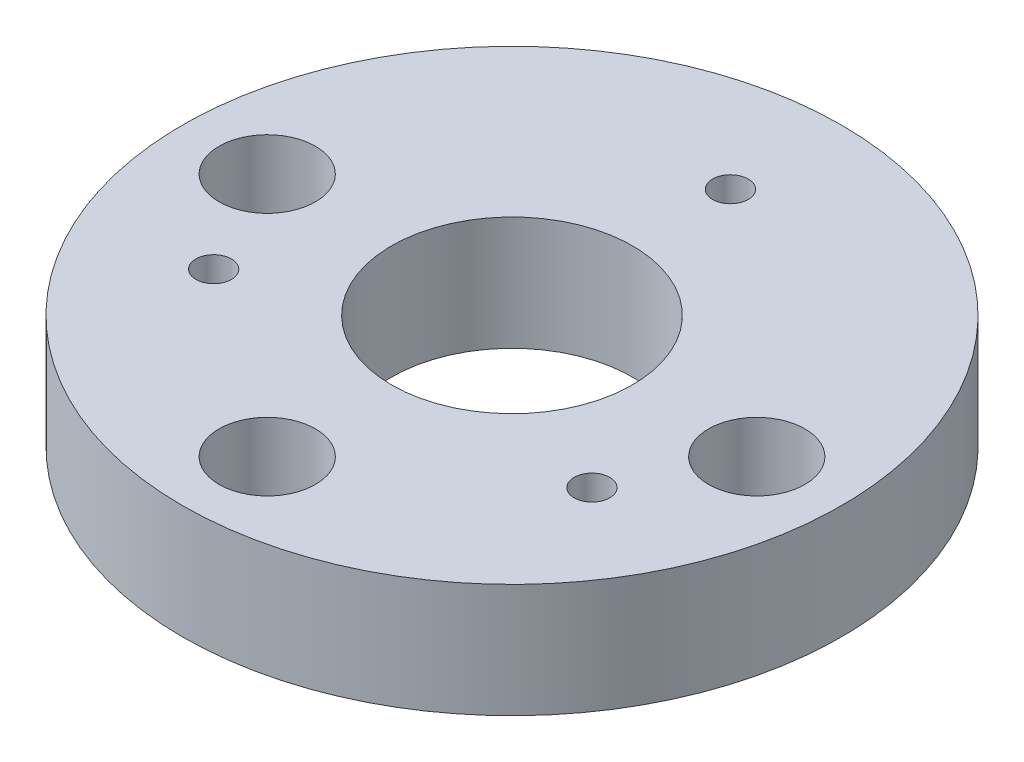
ISO-10303-21;
HEADER;
FILE_DESCRIPTION(('STEP AP214'),'2;1');
FILE_NAME('part.step','',(''),(''),'','','');
FILE_SCHEMA(('AUTOMOTIVE_DESIGN { 1 0 10303 214 1 1 1 1 }'));
ENDSEC;
DATA;
#1=APPLICATION_CONTEXT('core data for automotive mechanical design processes');
#2=APPLICATION_PROTOCOL_DEFINITION('international standard','automotive_design',2000,#1);
#3=PRODUCT_CONTEXT('',#1,'mechanical');
#4=PRODUCT('Part','Part','',(#3));
#5=PRODUCT_RELATED_PRODUCT_CATEGORY('part','',(#4));
#6=PRODUCT_DEFINITION_FORMATION('','',#4);
#7=PRODUCT_DEFINITION_CONTEXT('part definition',#1,'design');
#8=PRODUCT_DEFINITION('design','',#6,#7);
#9=PRODUCT_DEFINITION_SHAPE('','',#8);
#10=(LENGTH_UNIT() NAMED_UNIT(*) SI_UNIT(.MILLI.,.METRE.));
#11=(NAMED_UNIT(*) PLANE_ANGLE_UNIT() SI_UNIT($,.RADIAN.));
#12=(NAMED_UNIT(*) SI_UNIT($,.STERADIAN.) SOLID_ANGLE_UNIT());
#13=UNCERTAINTY_MEASURE_WITH_UNIT(LENGTH_MEASURE(1.E-05),#10,'distance_accuracy_value','');
#14=(GEOMETRIC_REPRESENTATION_CONTEXT(3) GLOBAL_UNCERTAINTY_ASSIGNED_CONTEXT((#13)) GLOBAL_UNIT_ASSIGNED_CONTEXT((#10,
#11,#12)) REPRESENTATION_CONTEXT('',''));
#15=CARTESIAN_POINT('',(0.,0.,0.));
#16=DIRECTION('',(0.,0.,1.));
#17=DIRECTION('',(1.,0.,0.));
#18=AXIS2_PLACEMENT_3D('',#15,#16,#17);
#19=CARTESIAN_POINT('',(20.6375,0.,0.));
#20=DIRECTION('',(0.,1.,0.));
#21=DIRECTION('',(0.,0.,1.));
#22=AXIS2_PLACEMENT_3D('',#19,#20,#21);
#23=CYLINDRICAL_SURFACE('',#22,1.83872486259726);
#24=CARTESIAN_POINT('',(20.6375,0.,0.));
#25=DIRECTION('',(0.,1.,0.));
#26=DIRECTION('',(0.,0.,1.));
#27=AXIS2_PLACEMENT_3D('',#24,#25,#26);
#28=CIRCLE('',#27,1.83872486259726);
#29=CARTESIAN_POINT('',(20.6375,0.,1.83872486259726));
#30=VERTEX_POINT('',#29);
#31=EDGE_CURVE('E82',#30,#30,#28,.T.);
#32=ORIENTED_EDGE('',*,*,#31,.F.);
#33=EDGE_LOOP('',(#32));
#34=FACE_BOUND('',#33,.T.);
#35=CARTESIAN_POINT('',(20.6375,3.5885,0.));
#36=DIRECTION('',(0.,1.,0.));
#37=DIRECTION('',(0.,0.,1.));
#38=AXIS2_PLACEMENT_3D('',#35,#36,#37);
#39=CIRCLE('',#38,1.83872486259726);
#40=CARTESIAN_POINT('',(20.6375,3.5885,1.83872486259726));
#41=VERTEX_POINT('',#40);
#42=EDGE_CURVE('E37',#41,#41,#39,.F.);
#43=ORIENTED_EDGE('',*,*,#42,.F.);
#44=EDGE_LOOP('',(#43));
#45=FACE_BOUND('',#44,.T.);
#46=ADVANCED_FACE('F33',(#34,#45),#23,.F.);
#47=CARTESIAN_POINT('',(0.,0.,20.6375));
#48=DIRECTION('',(0.,1.,0.));
#49=DIRECTION('',(0.,0.,1.));
#50=AXIS2_PLACEMENT_3D('',#47,#48,#49);
#51=CYLINDRICAL_SURFACE('',#50,1.83872486259726);
#52=CARTESIAN_POINT('',(0.,0.,20.6375));
#53=DIRECTION('',(0.,1.,0.));
#54=DIRECTION('',(0.,0.,1.));
#55=AXIS2_PLACEMENT_3D('',#52,#53,#54);
#56=CIRCLE('',#55,1.83872486259726);
#57=CARTESIAN_POINT('',(0.,0.,22.4762248625973));
#58=VERTEX_POINT('',#57);
#59=EDGE_CURVE('E79',#58,#58,#56,.T.);
#60=ORIENTED_EDGE('',*,*,#59,.F.);
#61=EDGE_LOOP('',(#60));
#62=FACE_BOUND('',#61,.T.);
#63=CARTESIAN_POINT('',(0.,3.5885,20.6375));
#64=DIRECTION('',(0.,1.,0.));
#65=DIRECTION('',(0.,0.,1.));
#66=AXIS2_PLACEMENT_3D('',#63,#64,#65);
#67=CIRCLE('',#66,1.83872486259726);
#68=CARTESIAN_POINT('',(0.,3.5885,22.4762248625973));
#69=VERTEX_POINT('',#68);
#70=EDGE_CURVE('E54',#69,#69,#67,.F.);
#71=ORIENTED_EDGE('',*,*,#70,.F.);
#72=EDGE_LOOP('',(#71));
#73=FACE_BOUND('',#72,.T.);
#74=ADVANCED_FACE('F159',(#62,#73),#51,.F.);
#75=CARTESIAN_POINT('',(-20.6375,0.,0.));
#76=DIRECTION('',(0.,1.,0.));
#77=DIRECTION('',(0.,0.,1.));
#78=AXIS2_PLACEMENT_3D('',#75,#76,#77);
#79=CYLINDRICAL_SURFACE('',#78,1.83872486259726);
#80=CARTESIAN_POINT('',(-20.6375,0.,0.));
#81=DIRECTION('',(0.,1.,0.));
#82=DIRECTION('',(0.,0.,1.));
#83=AXIS2_PLACEMENT_3D('',#80,#81,#82);
#84=CIRCLE('',#83,1.83872486259726);
#85=CARTESIAN_POINT('',(-20.6375,0.,1.83872486259726));
#86=VERTEX_POINT('',#85);
#87=EDGE_CURVE('E52',#86,#86,#84,.T.);
#88=ORIENTED_EDGE('',*,*,#87,.F.);
#89=EDGE_LOOP('',(#88));
#90=FACE_BOUND('',#89,.T.);
#91=CARTESIAN_POINT('',(-20.6375,3.5885,0.));
#92=DIRECTION('',(0.,1.,0.));
#93=DIRECTION('',(0.,0.,1.));
#94=AXIS2_PLACEMENT_3D('',#91,#92,#93);
#95=CIRCLE('',#94,1.83872486259726);
#96=CARTESIAN_POINT('',(-20.6375,3.5885,1.83872486259726));
#97=VERTEX_POINT('',#96);
#98=EDGE_CURVE('E50',#97,#97,#95,.F.);
#99=ORIENTED_EDGE('',*,*,#98,.F.);
#100=EDGE_LOOP('',(#99));
#101=FACE_BOUND('',#100,.T.);
#102=ADVANCED_FACE('F165',(#90,#101),#79,.F.);
#103=CARTESIAN_POINT('',(0.,9.5885,0.));
#104=DIRECTION('',(0.,1.,0.));
#105=DIRECTION('',(0.,0.,1.));
#106=AXIS2_PLACEMENT_3D('',#103,#104,#105);
#107=PLANE('',#106);
#108=CARTESIAN_POINT('',(0.,9.5885,20.6375));
#109=DIRECTION('',(0.,1.,0.));
#110=DIRECTION('',(0.,0.,1.));
#111=AXIS2_PLACEMENT_3D('',#108,#109,#110);
#112=CIRCLE('',#111,4.064);
#113=CARTESIAN_POINT('',(0.,9.5885,24.7015));
#114=VERTEX_POINT('',#113);
#115=EDGE_CURVE('E62',#114,#114,#112,.T.);
#116=ORIENTED_EDGE('',*,*,#115,.F.);
#117=EDGE_LOOP('',(#116));
#118=FACE_BOUND('',#117,.T.);
#119=CARTESIAN_POINT('',(20.6375,9.5885,0.));
#120=DIRECTION('',(0.,1.,0.));
#121=DIRECTION('',(0.,0.,1.));
#122=AXIS2_PLACEMENT_3D('',#119,#120,#121);
#123=CIRCLE('',#122,4.064);
#124=CARTESIAN_POINT('',(20.6375,9.5885,4.064));
#125=VERTEX_POINT('',#124);
#126=EDGE_CURVE('E72',#125,#125,#123,.T.);
#127=ORIENTED_EDGE('',*,*,#126,.F.);
#128=EDGE_LOOP('',(#127));
#129=FACE_BOUND('',#128,.T.);
#130=CARTESIAN_POINT('',(-20.6375,9.5885,0.));
#131=DIRECTION('',(0.,1.,0.));
#132=DIRECTION('',(0.,0.,1.));
#133=AXIS2_PLACEMENT_3D('',#130,#131,#132);
#134=CIRCLE('',#133,4.064);
#135=CARTESIAN_POINT('',(-20.6375,9.5885,4.064));
#136=VERTEX_POINT('',#135);
#137=EDGE_CURVE('E60',#136,#136,#134,.T.);
#138=ORIENTED_EDGE('',*,*,#137,.F.);
#139=EDGE_LOOP('',(#138));
#140=FACE_BOUND('',#139,.T.);
#141=CARTESIAN_POINT('',(15.9478578106922,9.5885,9.20750000000042));
#142=DIRECTION('',(0.,1.,0.));
#143=DIRECTION('',(0.,0.,1.));
#144=AXIS2_PLACEMENT_3D('',#141,#142,#143);
#145=CIRCLE('',#144,1.5);
#146=CARTESIAN_POINT('',(15.9478578106922,9.5885,10.7075000000004));
#147=VERTEX_POINT('',#146);
#148=EDGE_CURVE('E88',#147,#147,#145,.T.);
#149=ORIENTED_EDGE('',*,*,#148,.F.);
#150=EDGE_LOOP('',(#149));
#151=FACE_BOUND('',#150,.T.);
#152=CARTESIAN_POINT('',(-15.9478578106887,9.5885,9.20749999999958));
#153=DIRECTION('',(0.,1.,0.));
#154=DIRECTION('',(0.,0.,1.));
#155=AXIS2_PLACEMENT_3D('',#152,#153,#154);
#156=CIRCLE('',#155,1.5);
#157=CARTESIAN_POINT('',(-15.9478578106887,9.5885,10.7074999999996));
#158=VERTEX_POINT('',#157);
#159=EDGE_CURVE('E87',#158,#158,#156,.T.);
#160=ORIENTED_EDGE('',*,*,#159,.F.);
#161=EDGE_LOOP('',(#160));
#162=FACE_BOUND('',#161,.T.);
#163=CARTESIAN_POINT('',(2.51206143219242E-12,9.5885,-18.415));
#164=DIRECTION('',(0.,1.,0.));
#165=DIRECTION('',(0.,0.,1.));
#166=AXIS2_PLACEMENT_3D('',#163,#164,#165);
#167=CIRCLE('',#166,1.5);
#168=CARTESIAN_POINT('',(2.51206143219242E-12,9.5885,-16.915));
#169=VERTEX_POINT('',#168);
#170=EDGE_CURVE('E91',#169,#169,#167,.T.);
#171=ORIENTED_EDGE('',*,*,#170,.F.);
#172=EDGE_LOOP('',(#171));
#173=FACE_BOUND('',#172,.T.);
#174=CARTESIAN_POINT('',(0.,9.5885,0.));
#175=DIRECTION('',(0.,1.,0.));
#176=DIRECTION('',(0.,0.,1.));
#177=AXIS2_PLACEMENT_3D('',#174,#175,#176);
#178=CIRCLE('',#177,27.7876);
#179=CARTESIAN_POINT('',(0.,9.5885,27.7876));
#180=VERTEX_POINT('',#179);
#181=EDGE_CURVE('E103',#180,#180,#178,.T.);
#182=ORIENTED_EDGE('',*,*,#181,.T.);
#183=EDGE_LOOP('',(#182));
#184=FACE_BOUND('',#183,.T.);
#185=CARTESIAN_POINT('',(0.,9.5885,0.));
#186=DIRECTION('',(0.,1.,0.));
#187=DIRECTION('',(0.,0.,1.));
#188=AXIS2_PLACEMENT_3D('',#185,#186,#187);
#189=CIRCLE('',#188,10.16);
#190=CARTESIAN_POINT('',(0.,9.5885,10.16));
#191=VERTEX_POINT('',#190);
#192=EDGE_CURVE('E97',#191,#191,#189,.T.);
#193=ORIENTED_EDGE('',*,*,#192,.F.);
#194=EDGE_LOOP('',(#193));
#195=FACE_BOUND('',#194,.T.);
#196=ADVANCED_FACE('F134',(#118,#129,#140,#151,#162,#173,#184,#195),#107,.T.);
#197=CARTESIAN_POINT('',(0.,0.,0.));
#198=DIRECTION('',(0.,1.,0.));
#199=DIRECTION('',(0.,0.,1.));
#200=AXIS2_PLACEMENT_3D('',#197,#198,#199);
#201=PLANE('',#200);
#202=ORIENTED_EDGE('',*,*,#59,.T.);
#203=EDGE_LOOP('',(#202));
#204=FACE_BOUND('',#203,.T.);
#205=ORIENTED_EDGE('',*,*,#87,.T.);
#206=EDGE_LOOP('',(#205));
#207=FACE_BOUND('',#206,.T.);
#208=ORIENTED_EDGE('',*,*,#31,.T.);
#209=EDGE_LOOP('',(#208));
#210=FACE_BOUND('',#209,.T.);
#211=CARTESIAN_POINT('',(-15.9478578106887,0.,9.20749999999958));
#212=DIRECTION('',(0.,1.,0.));
#213=DIRECTION('',(0.,0.,1.));
#214=AXIS2_PLACEMENT_3D('',#211,#212,#213);
#215=CIRCLE('',#214,3.89999999999997);
#216=CARTESIAN_POINT('',(-15.9478578106887,0.,13.1074999999995));
#217=VERTEX_POINT('',#216);
#218=EDGE_CURVE('E114',#217,#217,#215,.T.);
#219=ORIENTED_EDGE('',*,*,#218,.T.);
#220=EDGE_LOOP('',(#219));
#221=FACE_BOUND('',#220,.T.);
#222=CARTESIAN_POINT('',(15.9478578106922,0.,9.20750000000042));
#223=DIRECTION('',(0.,1.,0.));
#224=DIRECTION('',(0.,0.,1.));
#225=AXIS2_PLACEMENT_3D('',#222,#223,#224);
#226=CIRCLE('',#225,3.89999999999999);
#227=CARTESIAN_POINT('',(15.9478578106922,0.,13.1075000000004));
#228=VERTEX_POINT('',#227);
#229=EDGE_CURVE('E111',#228,#228,#226,.T.);
#230=ORIENTED_EDGE('',*,*,#229,.T.);
#231=EDGE_LOOP('',(#230));
#232=FACE_BOUND('',#231,.T.);
#233=CARTESIAN_POINT('',(2.51206143219242E-12,0.,-18.415));
#234=DIRECTION('',(0.,1.,0.));
#235=DIRECTION('',(0.,0.,1.));
#236=AXIS2_PLACEMENT_3D('',#233,#234,#235);
#237=CIRCLE('',#236,3.89999999999997);
#238=CARTESIAN_POINT('',(2.51206143219242E-12,0.,-14.515));
#239=VERTEX_POINT('',#238);
#240=EDGE_CURVE('E106',#239,#239,#237,.T.);
#241=ORIENTED_EDGE('',*,*,#240,.T.);
#242=EDGE_LOOP('',(#241));
#243=FACE_BOUND('',#242,.T.);
#244=CARTESIAN_POINT('',(0.,0.,0.));
#245=DIRECTION('',(0.,1.,0.));
#246=DIRECTION('',(0.,0.,1.));
#247=AXIS2_PLACEMENT_3D('',#244,#245,#246);
#248=CIRCLE('',#247,27.7876);
#249=CARTESIAN_POINT('',(0.,0.,27.7876));
#250=VERTEX_POINT('',#249);
#251=EDGE_CURVE('E100',#250,#250,#248,.T.);
#252=ORIENTED_EDGE('',*,*,#251,.F.);
#253=EDGE_LOOP('',(#252));
#254=FACE_BOUND('',#253,.T.);
#255=CARTESIAN_POINT('',(0.,0.,0.));
#256=DIRECTION('',(0.,1.,0.));
#257=DIRECTION('',(0.,0.,1.));
#258=AXIS2_PLACEMENT_3D('',#255,#256,#257);
#259=CIRCLE('',#258,10.16);
#260=CARTESIAN_POINT('',(0.,0.,10.16));
#261=VERTEX_POINT('',#260);
#262=EDGE_CURVE('E96',#261,#261,#259,.T.);
#263=ORIENTED_EDGE('',*,*,#262,.T.);
#264=EDGE_LOOP('',(#263));
#265=FACE_BOUND('',#264,.T.);
#266=ADVANCED_FACE('F130',(#204,#207,#210,#221,#232,#243,#254,#265),#201,.F.);
#267=CARTESIAN_POINT('',(0.,9.5885,0.));
#268=DIRECTION('',(0.,-1.,0.));
#269=DIRECTION('',(0.,0.,-1.));
#270=AXIS2_PLACEMENT_3D('',#267,#268,#269);
#271=CYLINDRICAL_SURFACE('',#270,27.7876);
#272=ORIENTED_EDGE('',*,*,#181,.F.);
#273=EDGE_LOOP('',(#272));
#274=FACE_BOUND('',#273,.T.);
#275=ORIENTED_EDGE('',*,*,#251,.T.);
#276=EDGE_LOOP('',(#275));
#277=FACE_BOUND('',#276,.T.);
#278=ADVANCED_FACE('F133',(#274,#277),#271,.T.);
#279=CARTESIAN_POINT('',(0.,9.5885,0.));
#280=DIRECTION('',(0.,-1.,0.));
#281=DIRECTION('',(0.,0.,-1.));
#282=AXIS2_PLACEMENT_3D('',#279,#280,#281);
#283=CYLINDRICAL_SURFACE('',#282,10.16);
#284=ORIENTED_EDGE('',*,*,#192,.T.);
#285=EDGE_LOOP('',(#284));
#286=FACE_BOUND('',#285,.T.);
#287=ORIENTED_EDGE('',*,*,#262,.F.);
#288=EDGE_LOOP('',(#287));
#289=FACE_BOUND('',#288,.T.);
#290=ADVANCED_FACE('F145',(#286,#289),#283,.F.);
#291=CARTESIAN_POINT('',(2.51206143219242E-12,0.,-18.415));
#292=DIRECTION('',(0.,1.,0.));
#293=DIRECTION('',(0.,0.,1.));
#294=AXIS2_PLACEMENT_3D('',#291,#292,#293);
#295=CYLINDRICAL_SURFACE('',#294,1.5);
#296=CARTESIAN_POINT('',(2.51206143219242E-12,2.39999999999997,-18.415));
#297=DIRECTION('',(0.,1.,0.));
#298=DIRECTION('',(0.,0.,1.));
#299=AXIS2_PLACEMENT_3D('',#296,#297,#298);
#300=CIRCLE('',#299,1.5);
#301=CARTESIAN_POINT('',(2.51206143219242E-12,2.39999999999997,-16.915));
#302=VERTEX_POINT('',#301);
#303=EDGE_CURVE('E10',#302,#302,#300,.F.);
#304=ORIENTED_EDGE('',*,*,#303,.T.);
#305=EDGE_LOOP('',(#304));
#306=FACE_BOUND('',#305,.T.);
#307=ORIENTED_EDGE('',*,*,#170,.T.);
#308=EDGE_LOOP('',(#307));
#309=FACE_BOUND('',#308,.T.);
#310=ADVANCED_FACE('F147',(#306,#309),#295,.F.);
#311=CARTESIAN_POINT('',(-15.9478578106887,0.,9.20749999999958));
#312=DIRECTION('',(0.,1.,0.));
#313=DIRECTION('',(0.,0.,1.));
#314=AXIS2_PLACEMENT_3D('',#311,#312,#313);
#315=CYLINDRICAL_SURFACE('',#314,1.5);
#316=CARTESIAN_POINT('',(-15.9478578106887,2.39999999999997,9.20749999999958));
#317=DIRECTION('',(0.,1.,0.));
#318=DIRECTION('',(0.,0.,1.));
#319=AXIS2_PLACEMENT_3D('',#316,#317,#318);
#320=CIRCLE('',#319,1.5);
#321=CARTESIAN_POINT('',(-15.9478578106887,2.39999999999997,10.7074999999996));
#322=VERTEX_POINT('',#321);
#323=EDGE_CURVE('E46',#322,#322,#320,.F.);
#324=ORIENTED_EDGE('',*,*,#323,.T.);
#325=EDGE_LOOP('',(#324));
#326=FACE_BOUND('',#325,.T.);
#327=ORIENTED_EDGE('',*,*,#159,.T.);
#328=EDGE_LOOP('',(#327));
#329=FACE_BOUND('',#328,.T.);
#330=ADVANCED_FACE('F119',(#326,#329),#315,.F.);
#331=CARTESIAN_POINT('',(15.9478578106922,0.,9.20750000000042));
#332=DIRECTION('',(0.,1.,0.));
#333=DIRECTION('',(0.,0.,1.));
#334=AXIS2_PLACEMENT_3D('',#331,#332,#333);
#335=CYLINDRICAL_SURFACE('',#334,1.5);
#336=CARTESIAN_POINT('',(15.9478578106922,2.39999999999999,9.20750000000042));
#337=DIRECTION('',(0.,1.,0.));
#338=DIRECTION('',(0.,0.,1.));
#339=AXIS2_PLACEMENT_3D('',#336,#337,#338);
#340=CIRCLE('',#339,1.5);
#341=CARTESIAN_POINT('',(15.9478578106922,2.39999999999999,10.7075000000004));
#342=VERTEX_POINT('',#341);
#343=EDGE_CURVE('E41',#342,#342,#340,.F.);
#344=ORIENTED_EDGE('',*,*,#343,.T.);
#345=EDGE_LOOP('',(#344));
#346=FACE_BOUND('',#345,.T.);
#347=ORIENTED_EDGE('',*,*,#148,.T.);
#348=EDGE_LOOP('',(#347));
#349=FACE_BOUND('',#348,.T.);
#350=ADVANCED_FACE('F126',(#346,#349),#335,.F.);
#351=CARTESIAN_POINT('',(-15.9478578106887,0.,9.20749999999958));
#352=DIRECTION('',(0.,-1.,0.));
#353=DIRECTION('',(0.,0.,-1.));
#354=AXIS2_PLACEMENT_3D('',#351,#352,#353);
#355=CONICAL_SURFACE('',#354,3.89999999999997,0.785398163397448);
#356=ORIENTED_EDGE('',*,*,#323,.F.);
#357=EDGE_LOOP('',(#356));
#358=FACE_BOUND('',#357,.T.);
#359=ORIENTED_EDGE('',*,*,#218,.F.);
#360=EDGE_LOOP('',(#359));
#361=FACE_BOUND('',#360,.T.);
#362=ADVANCED_FACE('F122',(#358,#361),#355,.F.);
#363=CARTESIAN_POINT('',(15.9478578106922,0.,9.20750000000042));
#364=DIRECTION('',(0.,-1.,0.));
#365=DIRECTION('',(0.,0.,-1.));
#366=AXIS2_PLACEMENT_3D('',#363,#364,#365);
#367=CONICAL_SURFACE('',#366,3.89999999999999,0.785398163397448);
#368=ORIENTED_EDGE('',*,*,#343,.F.);
#369=EDGE_LOOP('',(#368));
#370=FACE_BOUND('',#369,.T.);
#371=ORIENTED_EDGE('',*,*,#229,.F.);
#372=EDGE_LOOP('',(#371));
#373=FACE_BOUND('',#372,.T.);
#374=ADVANCED_FACE('F125',(#370,#373),#367,.F.);
#375=CARTESIAN_POINT('',(2.51206143219242E-12,0.,-18.415));
#376=DIRECTION('',(0.,-1.,0.));
#377=DIRECTION('',(0.,0.,-1.));
#378=AXIS2_PLACEMENT_3D('',#375,#376,#377);
#379=CONICAL_SURFACE('',#378,3.89999999999997,0.785398163397447);
#380=ORIENTED_EDGE('',*,*,#303,.F.);
#381=EDGE_LOOP('',(#380));
#382=FACE_BOUND('',#381,.T.);
#383=ORIENTED_EDGE('',*,*,#240,.F.);
#384=EDGE_LOOP('',(#383));
#385=FACE_BOUND('',#384,.T.);
#386=ADVANCED_FACE('F35',(#382,#385),#379,.F.);
#387=CARTESIAN_POINT('',(-20.6375,3.5885,0.));
#388=DIRECTION('',(0.,1.,0.));
#389=DIRECTION('',(0.,0.,1.));
#390=AXIS2_PLACEMENT_3D('',#387,#388,#389);
#391=PLANE('',#390);
#392=CARTESIAN_POINT('',(-20.6375,3.5885,0.));
#393=DIRECTION('',(0.,1.,0.));
#394=DIRECTION('',(0.,0.,1.));
#395=AXIS2_PLACEMENT_3D('',#392,#393,#394);
#396=CIRCLE('',#395,4.064);
#397=CARTESIAN_POINT('',(-20.6375,3.5885,4.064));
#398=VERTEX_POINT('',#397);
#399=EDGE_CURVE('E53',#398,#398,#396,.T.);
#400=ORIENTED_EDGE('',*,*,#399,.T.);
#401=EDGE_LOOP('',(#400));
#402=FACE_BOUND('',#401,.T.);
#403=ORIENTED_EDGE('',*,*,#98,.T.);
#404=EDGE_LOOP('',(#403));
#405=FACE_BOUND('',#404,.T.);
#406=ADVANCED_FACE('F200',(#402,#405),#391,.T.);
#407=CARTESIAN_POINT('',(-20.6375,3.5885,0.));
#408=DIRECTION('',(0.,1.,0.));
#409=DIRECTION('',(0.,0.,1.));
#410=AXIS2_PLACEMENT_3D('',#407,#408,#409);
#411=CYLINDRICAL_SURFACE('',#410,4.064);
#412=ORIENTED_EDGE('',*,*,#399,.F.);
#413=EDGE_LOOP('',(#412));
#414=FACE_BOUND('',#413,.T.);
#415=ORIENTED_EDGE('',*,*,#137,.T.);
#416=EDGE_LOOP('',(#415));
#417=FACE_BOUND('',#416,.T.);
#418=ADVANCED_FACE('F208',(#414,#417),#411,.F.);
#419=CARTESIAN_POINT('',(0.,3.5885,20.6375));
#420=DIRECTION('',(0.,1.,0.));
#421=DIRECTION('',(0.,0.,1.));
#422=AXIS2_PLACEMENT_3D('',#419,#420,#421);
#423=PLANE('',#422);
#424=CARTESIAN_POINT('',(0.,3.5885,20.6375));
#425=DIRECTION('',(0.,1.,0.));
#426=DIRECTION('',(0.,0.,1.));
#427=AXIS2_PLACEMENT_3D('',#424,#425,#426);
#428=CIRCLE('',#427,4.064);
#429=CARTESIAN_POINT('',(0.,3.5885,24.7015));
#430=VERTEX_POINT('',#429);
#431=EDGE_CURVE('E56',#430,#430,#428,.T.);
#432=ORIENTED_EDGE('',*,*,#431,.T.);
#433=EDGE_LOOP('',(#432));
#434=FACE_BOUND('',#433,.T.);
#435=ORIENTED_EDGE('',*,*,#70,.T.);
#436=EDGE_LOOP('',(#435));
#437=FACE_BOUND('',#436,.T.);
#438=ADVANCED_FACE('F217',(#434,#437),#423,.T.);
#439=CARTESIAN_POINT('',(0.,3.5885,20.6375));
#440=DIRECTION('',(0.,1.,0.));
#441=DIRECTION('',(0.,0.,1.));
#442=AXIS2_PLACEMENT_3D('',#439,#440,#441);
#443=CYLINDRICAL_SURFACE('',#442,4.064);
#444=ORIENTED_EDGE('',*,*,#431,.F.);
#445=EDGE_LOOP('',(#444));
#446=FACE_BOUND('',#445,.T.);
#447=ORIENTED_EDGE('',*,*,#115,.T.);
#448=EDGE_LOOP('',(#447));
#449=FACE_BOUND('',#448,.T.);
#450=ADVANCED_FACE('F225',(#446,#449),#443,.F.);
#451=CARTESIAN_POINT('',(20.6375,3.5885,0.));
#452=DIRECTION('',(0.,1.,0.));
#453=DIRECTION('',(0.,0.,1.));
#454=AXIS2_PLACEMENT_3D('',#451,#452,#453);
#455=PLANE('',#454);
#456=CARTESIAN_POINT('',(20.6375,3.5885,0.));
#457=DIRECTION('',(0.,1.,0.));
#458=DIRECTION('',(0.,0.,1.));
#459=AXIS2_PLACEMENT_3D('',#456,#457,#458);
#460=CIRCLE('',#459,4.064);
#461=CARTESIAN_POINT('',(20.6375,3.5885,4.064));
#462=VERTEX_POINT('',#461);
#463=EDGE_CURVE('E67',#462,#462,#460,.T.);
#464=ORIENTED_EDGE('',*,*,#463,.T.);
#465=EDGE_LOOP('',(#464));
#466=FACE_BOUND('',#465,.T.);
#467=ORIENTED_EDGE('',*,*,#42,.T.);
#468=EDGE_LOOP('',(#467));
#469=FACE_BOUND('',#468,.T.);
#470=ADVANCED_FACE('F232',(#466,#469),#455,.T.);
#471=CARTESIAN_POINT('',(20.6375,3.5885,0.));
#472=DIRECTION('',(0.,1.,0.));
#473=DIRECTION('',(0.,0.,1.));
#474=AXIS2_PLACEMENT_3D('',#471,#472,#473);
#475=CYLINDRICAL_SURFACE('',#474,4.064);
#476=ORIENTED_EDGE('',*,*,#463,.F.);
#477=EDGE_LOOP('',(#476));
#478=FACE_BOUND('',#477,.T.);
#479=ORIENTED_EDGE('',*,*,#126,.T.);
#480=EDGE_LOOP('',(#479));
#481=FACE_BOUND('',#480,.T.);
#482=ADVANCED_FACE('F240',(#478,#481),#475,.F.);
#483=CLOSED_SHELL('',(#46,#74,#102,#196,#266,#278,#290,#310,#330,#350,#362,#374,#386,#406,#418,
#438,#450,#470,#482));
#484=MANIFOLD_SOLID_BREP('B2',#483);
#485=ADVANCED_BREP_SHAPE_REPRESENTATION('',(#18,#484),#14);
#486=SHAPE_DEFINITION_REPRESENTATION(#9,#485);
ENDSEC;
END-ISO-10303-21;
